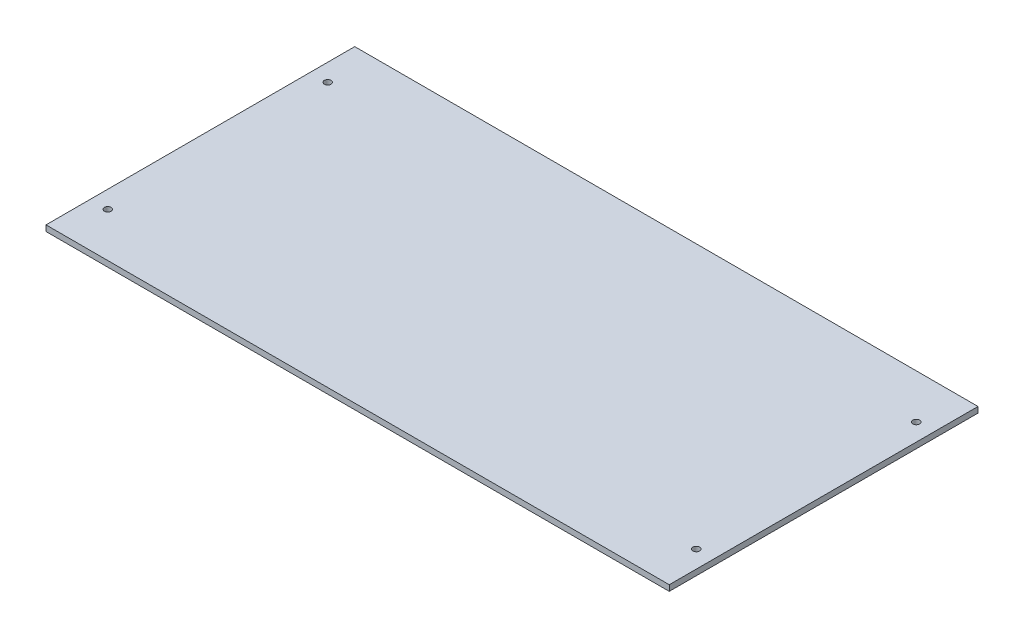
ISO-10303-21;
HEADER;
FILE_DESCRIPTION(('STEP AP214'),'2;1');
FILE_NAME('part.step','',(''),(''),'','','');
FILE_SCHEMA(('AUTOMOTIVE_DESIGN { 1 0 10303 214 1 1 1 1 }'));
ENDSEC;
DATA;
#1=APPLICATION_CONTEXT('core data for automotive mechanical design processes');
#2=APPLICATION_PROTOCOL_DEFINITION('international standard','automotive_design',2000,#1);
#3=PRODUCT_CONTEXT('',#1,'mechanical');
#4=PRODUCT('Part','Part','',(#3));
#5=PRODUCT_RELATED_PRODUCT_CATEGORY('part','',(#4));
#6=PRODUCT_DEFINITION_FORMATION('','',#4);
#7=PRODUCT_DEFINITION_CONTEXT('part definition',#1,'design');
#8=PRODUCT_DEFINITION('design','',#6,#7);
#9=PRODUCT_DEFINITION_SHAPE('','',#8);
#10=(LENGTH_UNIT() NAMED_UNIT(*) SI_UNIT(.MILLI.,.METRE.));
#11=(NAMED_UNIT(*) PLANE_ANGLE_UNIT() SI_UNIT($,.RADIAN.));
#12=(NAMED_UNIT(*) SI_UNIT($,.STERADIAN.) SOLID_ANGLE_UNIT());
#13=UNCERTAINTY_MEASURE_WITH_UNIT(LENGTH_MEASURE(1.E-05),#10,'distance_accuracy_value','');
#14=(GEOMETRIC_REPRESENTATION_CONTEXT(3) GLOBAL_UNCERTAINTY_ASSIGNED_CONTEXT((#13)) GLOBAL_UNIT_ASSIGNED_CONTEXT((#10,
#11,#12)) REPRESENTATION_CONTEXT('',''));
#15=CARTESIAN_POINT('',(0.,0.,0.));
#16=DIRECTION('',(0.,0.,1.));
#17=DIRECTION('',(1.,0.,0.));
#18=AXIS2_PLACEMENT_3D('',#15,#16,#17);
#19=CARTESIAN_POINT('',(161.5,3.,-80.));
#20=DIRECTION('',(-1.,0.,0.));
#21=DIRECTION('',(0.,0.,1.));
#22=AXIS2_PLACEMENT_3D('',#19,#20,#21);
#23=PLANE('',#22);
#24=DIRECTION('',(0.,0.,-1.));
#25=VECTOR('',#24,1.);
#26=CARTESIAN_POINT('',(161.5,0.,-80.));
#27=LINE('',#26,#25);
#28=CARTESIAN_POINT('',(161.5,0.,80.));
#29=VERTEX_POINT('',#28);
#30=CARTESIAN_POINT('',(161.5,0.,-80.));
#31=VERTEX_POINT('',#30);
#32=EDGE_CURVE('E101',#29,#31,#27,.T.);
#33=ORIENTED_EDGE('',*,*,#32,.T.);
#34=DIRECTION('',(0.,-1.,0.));
#35=VECTOR('',#34,1.);
#36=CARTESIAN_POINT('',(161.5,3.,-80.));
#37=LINE('',#36,#35);
#38=CARTESIAN_POINT('',(161.5,3.,-80.));
#39=VERTEX_POINT('',#38);
#40=EDGE_CURVE('E11',#39,#31,#37,.T.);
#41=ORIENTED_EDGE('',*,*,#40,.F.);
#42=DIRECTION('',(0.,0.,-1.));
#43=VECTOR('',#42,1.);
#44=CARTESIAN_POINT('',(161.5,3.,-80.));
#45=LINE('',#44,#43);
#46=CARTESIAN_POINT('',(161.5,3.,80.));
#47=VERTEX_POINT('',#46);
#48=EDGE_CURVE('E89',#47,#39,#45,.T.);
#49=ORIENTED_EDGE('',*,*,#48,.F.);
#50=DIRECTION('',(0.,-1.,0.));
#51=VECTOR('',#50,1.);
#52=CARTESIAN_POINT('',(161.5,3.,80.));
#53=LINE('',#52,#51);
#54=EDGE_CURVE('E97',#47,#29,#53,.T.);
#55=ORIENTED_EDGE('',*,*,#54,.T.);
#56=EDGE_LOOP('',(#33,#41,#49,#55));
#57=FACE_BOUND('',#56,.T.);
#58=ADVANCED_FACE('F38',(#57),#23,.F.);
#59=CARTESIAN_POINT('',(-161.5,3.,-80.));
#60=DIRECTION('',(0.,0.,1.));
#61=DIRECTION('',(1.,0.,0.));
#62=AXIS2_PLACEMENT_3D('',#59,#60,#61);
#63=PLANE('',#62);
#64=DIRECTION('',(-1.,0.,0.));
#65=VECTOR('',#64,1.);
#66=CARTESIAN_POINT('',(-161.5,0.,-80.));
#67=LINE('',#66,#65);
#68=CARTESIAN_POINT('',(-161.5,0.,-80.));
#69=VERTEX_POINT('',#68);
#70=EDGE_CURVE('E93',#31,#69,#67,.T.);
#71=ORIENTED_EDGE('',*,*,#70,.T.);
#72=DIRECTION('',(0.,-1.,0.));
#73=VECTOR('',#72,1.);
#74=CARTESIAN_POINT('',(-161.5,3.,-80.));
#75=LINE('',#74,#73);
#76=CARTESIAN_POINT('',(-161.5,3.,-80.));
#77=VERTEX_POINT('',#76);
#78=EDGE_CURVE('E46',#77,#69,#75,.T.);
#79=ORIENTED_EDGE('',*,*,#78,.F.);
#80=DIRECTION('',(-1.,0.,0.));
#81=VECTOR('',#80,1.);
#82=CARTESIAN_POINT('',(-161.5,3.,-80.));
#83=LINE('',#82,#81);
#84=EDGE_CURVE('E84',#39,#77,#83,.T.);
#85=ORIENTED_EDGE('',*,*,#84,.F.);
#86=ORIENTED_EDGE('',*,*,#40,.T.);
#87=EDGE_LOOP('',(#71,#79,#85,#86));
#88=FACE_BOUND('',#87,.T.);
#89=ADVANCED_FACE('F92',(#88),#63,.F.);
#90=CARTESIAN_POINT('',(-161.5,3.,-80.));
#91=DIRECTION('',(1.,0.,0.));
#92=DIRECTION('',(0.,0.,-1.));
#93=AXIS2_PLACEMENT_3D('',#90,#91,#92);
#94=PLANE('',#93);
#95=DIRECTION('',(0.,0.,1.));
#96=VECTOR('',#95,1.);
#97=CARTESIAN_POINT('',(-161.5,0.,-80.));
#98=LINE('',#97,#96);
#99=CARTESIAN_POINT('',(-161.5,0.,80.));
#100=VERTEX_POINT('',#99);
#101=EDGE_CURVE('E71',#69,#100,#98,.T.);
#102=ORIENTED_EDGE('',*,*,#101,.T.);
#103=DIRECTION('',(0.,-1.,0.));
#104=VECTOR('',#103,1.);
#105=CARTESIAN_POINT('',(-161.5,3.,80.));
#106=LINE('',#105,#104);
#107=CARTESIAN_POINT('',(-161.5,3.,80.));
#108=VERTEX_POINT('',#107);
#109=EDGE_CURVE('E94',#108,#100,#106,.T.);
#110=ORIENTED_EDGE('',*,*,#109,.F.);
#111=DIRECTION('',(0.,0.,1.));
#112=VECTOR('',#111,1.);
#113=CARTESIAN_POINT('',(-161.5,3.,-80.));
#114=LINE('',#113,#112);
#115=EDGE_CURVE('E87',#77,#108,#114,.T.);
#116=ORIENTED_EDGE('',*,*,#115,.F.);
#117=ORIENTED_EDGE('',*,*,#78,.T.);
#118=EDGE_LOOP('',(#102,#110,#116,#117));
#119=FACE_BOUND('',#118,.T.);
#120=ADVANCED_FACE('F95',(#119),#94,.F.);
#121=CARTESIAN_POINT('',(-161.5,3.,80.));
#122=DIRECTION('',(0.,0.,-1.));
#123=DIRECTION('',(-1.,0.,0.));
#124=AXIS2_PLACEMENT_3D('',#121,#122,#123);
#125=PLANE('',#124);
#126=DIRECTION('',(1.,0.,0.));
#127=VECTOR('',#126,1.);
#128=CARTESIAN_POINT('',(-161.5,0.,80.));
#129=LINE('',#128,#127);
#130=EDGE_CURVE('E77',#100,#29,#129,.T.);
#131=ORIENTED_EDGE('',*,*,#130,.T.);
#132=ORIENTED_EDGE('',*,*,#54,.F.);
#133=DIRECTION('',(1.,0.,0.));
#134=VECTOR('',#133,1.);
#135=CARTESIAN_POINT('',(-161.5,3.,80.));
#136=LINE('',#135,#134);
#137=EDGE_CURVE('E54',#108,#47,#136,.T.);
#138=ORIENTED_EDGE('',*,*,#137,.F.);
#139=ORIENTED_EDGE('',*,*,#109,.T.);
#140=EDGE_LOOP('',(#131,#132,#138,#139));
#141=FACE_BOUND('',#140,.T.);
#142=ADVANCED_FACE('F109',(#141),#125,.F.);
#143=CARTESIAN_POINT('',(0.,3.,0.));
#144=DIRECTION('',(0.,1.,0.));
#145=DIRECTION('',(0.,0.,1.));
#146=AXIS2_PLACEMENT_3D('',#143,#144,#145);
#147=PLANE('',#146);
#148=CARTESIAN_POINT('',(-152.5,3.,57.));
#149=DIRECTION('',(0.,-1.,0.));
#150=DIRECTION('',(0.,0.,1.));
#151=AXIS2_PLACEMENT_3D('',#148,#149,#150);
#152=CIRCLE('',#151,1.75000000000001);
#153=CARTESIAN_POINT('',(-152.5,3.,58.75));
#154=VERTEX_POINT('',#153);
#155=EDGE_CURVE('E121',#154,#154,#152,.T.);
#156=ORIENTED_EDGE('',*,*,#155,.T.);
#157=EDGE_LOOP('',(#156));
#158=FACE_BOUND('',#157,.T.);
#159=CARTESIAN_POINT('',(152.5,3.,57.));
#160=DIRECTION('',(0.,-1.,0.));
#161=DIRECTION('',(0.,0.,1.));
#162=AXIS2_PLACEMENT_3D('',#159,#160,#161);
#163=CIRCLE('',#162,1.75000000000001);
#164=CARTESIAN_POINT('',(152.5,3.,58.75));
#165=VERTEX_POINT('',#164);
#166=EDGE_CURVE('E127',#165,#165,#163,.T.);
#167=ORIENTED_EDGE('',*,*,#166,.T.);
#168=EDGE_LOOP('',(#167));
#169=FACE_BOUND('',#168,.T.);
#170=CARTESIAN_POINT('',(152.5,3.,-57.));
#171=DIRECTION('',(0.,-1.,0.));
#172=DIRECTION('',(0.,0.,-1.));
#173=AXIS2_PLACEMENT_3D('',#170,#171,#172);
#174=CIRCLE('',#173,1.75000000000001);
#175=CARTESIAN_POINT('',(152.5,3.,-58.75));
#176=VERTEX_POINT('',#175);
#177=EDGE_CURVE('E133',#176,#176,#174,.T.);
#178=ORIENTED_EDGE('',*,*,#177,.T.);
#179=EDGE_LOOP('',(#178));
#180=FACE_BOUND('',#179,.T.);
#181=CARTESIAN_POINT('',(-152.5,3.,-57.));
#182=DIRECTION('',(0.,-1.,0.));
#183=DIRECTION('',(0.,0.,-1.));
#184=AXIS2_PLACEMENT_3D('',#181,#182,#183);
#185=CIRCLE('',#184,1.75000000000001);
#186=CARTESIAN_POINT('',(-152.5,3.,-58.75));
#187=VERTEX_POINT('',#186);
#188=EDGE_CURVE('E104',#187,#187,#185,.T.);
#189=ORIENTED_EDGE('',*,*,#188,.T.);
#190=EDGE_LOOP('',(#189));
#191=FACE_BOUND('',#190,.T.);
#192=ORIENTED_EDGE('',*,*,#48,.T.);
#193=ORIENTED_EDGE('',*,*,#84,.T.);
#194=ORIENTED_EDGE('',*,*,#115,.T.);
#195=ORIENTED_EDGE('',*,*,#137,.T.);
#196=EDGE_LOOP('',(#192,#193,#194,#195));
#197=FACE_BOUND('',#196,.T.);
#198=ADVANCED_FACE('F85',(#158,#169,#180,#191,#197),#147,.T.);
#199=CARTESIAN_POINT('',(0.,0.,0.));
#200=DIRECTION('',(0.,1.,0.));
#201=DIRECTION('',(0.,0.,1.));
#202=AXIS2_PLACEMENT_3D('',#199,#200,#201);
#203=PLANE('',#202);
#204=CARTESIAN_POINT('',(-152.5,0.,57.));
#205=DIRECTION('',(0.,-1.,0.));
#206=DIRECTION('',(0.,0.,1.));
#207=AXIS2_PLACEMENT_3D('',#204,#205,#206);
#208=CIRCLE('',#207,1.75000000000001);
#209=CARTESIAN_POINT('',(-152.5,0.,58.75));
#210=VERTEX_POINT('',#209);
#211=EDGE_CURVE('E124',#210,#210,#208,.T.);
#212=ORIENTED_EDGE('',*,*,#211,.F.);
#213=EDGE_LOOP('',(#212));
#214=FACE_BOUND('',#213,.T.);
#215=CARTESIAN_POINT('',(152.5,0.,57.));
#216=DIRECTION('',(0.,-1.,0.));
#217=DIRECTION('',(0.,0.,1.));
#218=AXIS2_PLACEMENT_3D('',#215,#216,#217);
#219=CIRCLE('',#218,1.75000000000001);
#220=CARTESIAN_POINT('',(152.5,0.,58.75));
#221=VERTEX_POINT('',#220);
#222=EDGE_CURVE('E130',#221,#221,#219,.T.);
#223=ORIENTED_EDGE('',*,*,#222,.F.);
#224=EDGE_LOOP('',(#223));
#225=FACE_BOUND('',#224,.T.);
#226=CARTESIAN_POINT('',(152.5,0.,-57.));
#227=DIRECTION('',(0.,-1.,0.));
#228=DIRECTION('',(0.,0.,-1.));
#229=AXIS2_PLACEMENT_3D('',#226,#227,#228);
#230=CIRCLE('',#229,1.75000000000001);
#231=CARTESIAN_POINT('',(152.5,0.,-58.75));
#232=VERTEX_POINT('',#231);
#233=EDGE_CURVE('E118',#232,#232,#230,.T.);
#234=ORIENTED_EDGE('',*,*,#233,.F.);
#235=EDGE_LOOP('',(#234));
#236=FACE_BOUND('',#235,.T.);
#237=CARTESIAN_POINT('',(-152.5,0.,-57.));
#238=DIRECTION('',(0.,-1.,0.));
#239=DIRECTION('',(0.,0.,-1.));
#240=AXIS2_PLACEMENT_3D('',#237,#238,#239);
#241=CIRCLE('',#240,1.75000000000001);
#242=CARTESIAN_POINT('',(-152.5,0.,-58.75));
#243=VERTEX_POINT('',#242);
#244=EDGE_CURVE('E115',#243,#243,#241,.T.);
#245=ORIENTED_EDGE('',*,*,#244,.F.);
#246=EDGE_LOOP('',(#245));
#247=FACE_BOUND('',#246,.T.);
#248=ORIENTED_EDGE('',*,*,#32,.F.);
#249=ORIENTED_EDGE('',*,*,#130,.F.);
#250=ORIENTED_EDGE('',*,*,#101,.F.);
#251=ORIENTED_EDGE('',*,*,#70,.F.);
#252=EDGE_LOOP('',(#248,#249,#250,#251));
#253=FACE_BOUND('',#252,.T.);
#254=ADVANCED_FACE('F112',(#214,#225,#236,#247,#253),#203,.F.);
#255=CARTESIAN_POINT('',(-152.5,3.,-57.));
#256=DIRECTION('',(0.,-1.,0.));
#257=DIRECTION('',(0.,0.,-1.));
#258=AXIS2_PLACEMENT_3D('',#255,#256,#257);
#259=CYLINDRICAL_SURFACE('',#258,1.75000000000001);
#260=ORIENTED_EDGE('',*,*,#188,.F.);
#261=EDGE_LOOP('',(#260));
#262=FACE_BOUND('',#261,.T.);
#263=ORIENTED_EDGE('',*,*,#244,.T.);
#264=EDGE_LOOP('',(#263));
#265=FACE_BOUND('',#264,.T.);
#266=ADVANCED_FACE('F143',(#262,#265),#259,.F.);
#267=CARTESIAN_POINT('',(152.5,3.,-57.));
#268=DIRECTION('',(0.,-1.,0.));
#269=DIRECTION('',(0.,0.,-1.));
#270=AXIS2_PLACEMENT_3D('',#267,#268,#269);
#271=CYLINDRICAL_SURFACE('',#270,1.75000000000001);
#272=ORIENTED_EDGE('',*,*,#177,.F.);
#273=EDGE_LOOP('',(#272));
#274=FACE_BOUND('',#273,.T.);
#275=ORIENTED_EDGE('',*,*,#233,.T.);
#276=EDGE_LOOP('',(#275));
#277=FACE_BOUND('',#276,.T.);
#278=ADVANCED_FACE('F139',(#274,#277),#271,.F.);
#279=CARTESIAN_POINT('',(152.5,3.,57.));
#280=DIRECTION('',(0.,-1.,0.));
#281=DIRECTION('',(0.,0.,-1.));
#282=AXIS2_PLACEMENT_3D('',#279,#280,#281);
#283=CYLINDRICAL_SURFACE('',#282,1.75000000000001);
#284=ORIENTED_EDGE('',*,*,#166,.F.);
#285=EDGE_LOOP('',(#284));
#286=FACE_BOUND('',#285,.T.);
#287=ORIENTED_EDGE('',*,*,#222,.T.);
#288=EDGE_LOOP('',(#287));
#289=FACE_BOUND('',#288,.T.);
#290=ADVANCED_FACE('F154',(#286,#289),#283,.F.);
#291=CARTESIAN_POINT('',(-152.5,3.,57.));
#292=DIRECTION('',(0.,-1.,0.));
#293=DIRECTION('',(0.,0.,-1.));
#294=AXIS2_PLACEMENT_3D('',#291,#292,#293);
#295=CYLINDRICAL_SURFACE('',#294,1.75000000000001);
#296=ORIENTED_EDGE('',*,*,#155,.F.);
#297=EDGE_LOOP('',(#296));
#298=FACE_BOUND('',#297,.T.);
#299=ORIENTED_EDGE('',*,*,#211,.T.);
#300=EDGE_LOOP('',(#299));
#301=FACE_BOUND('',#300,.T.);
#302=ADVANCED_FACE('F183',(#298,#301),#295,.F.);
#303=CLOSED_SHELL('',(#58,#89,#120,#142,#198,#254,#266,#278,#290,#302));
#304=MANIFOLD_SOLID_BREP('B2',#303);
#305=ADVANCED_BREP_SHAPE_REPRESENTATION('',(#18,#304),#14);
#306=SHAPE_DEFINITION_REPRESENTATION(#9,#305);
ENDSEC;
END-ISO-10303-21;
